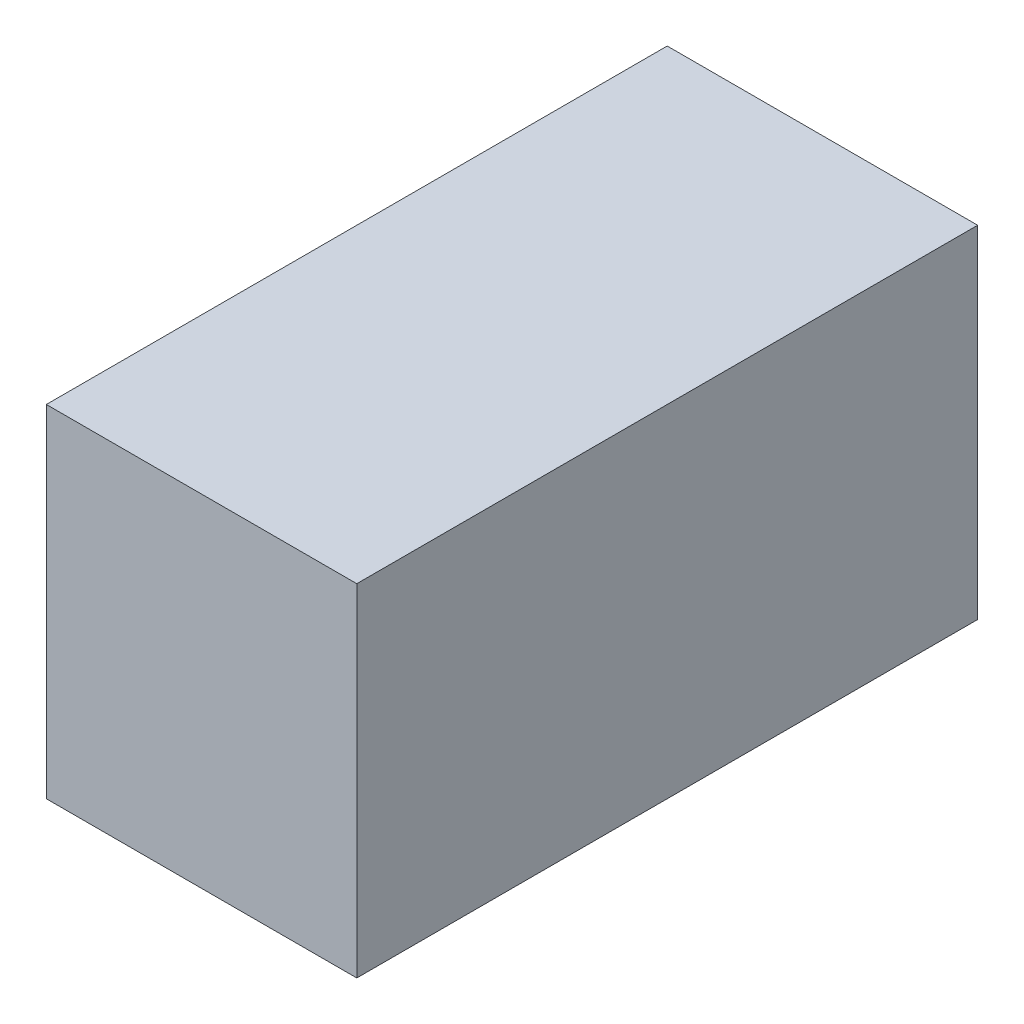
ISO-10303-21;
HEADER;
FILE_DESCRIPTION(('STEP AP214'),'2;1');
FILE_NAME('part.step','',(''),(''),'','','');
FILE_SCHEMA(('AUTOMOTIVE_DESIGN { 1 0 10303 214 1 1 1 1 }'));
ENDSEC;
DATA;
#1=APPLICATION_CONTEXT('core data for automotive mechanical design processes');
#2=APPLICATION_PROTOCOL_DEFINITION('international standard','automotive_design',2000,#1);
#3=PRODUCT_CONTEXT('',#1,'mechanical');
#4=PRODUCT('Part','Part','',(#3));
#5=PRODUCT_RELATED_PRODUCT_CATEGORY('part','',(#4));
#6=PRODUCT_DEFINITION_FORMATION('','',#4);
#7=PRODUCT_DEFINITION_CONTEXT('part definition',#1,'design');
#8=PRODUCT_DEFINITION('design','',#6,#7);
#9=PRODUCT_DEFINITION_SHAPE('','',#8);
#10=(LENGTH_UNIT() NAMED_UNIT(*) SI_UNIT(.MILLI.,.METRE.));
#11=(NAMED_UNIT(*) PLANE_ANGLE_UNIT() SI_UNIT($,.RADIAN.));
#12=(NAMED_UNIT(*) SI_UNIT($,.STERADIAN.) SOLID_ANGLE_UNIT());
#13=UNCERTAINTY_MEASURE_WITH_UNIT(LENGTH_MEASURE(1.E-05),#10,'distance_accuracy_value','');
#14=(GEOMETRIC_REPRESENTATION_CONTEXT(3) GLOBAL_UNCERTAINTY_ASSIGNED_CONTEXT((#13)) GLOBAL_UNIT_ASSIGNED_CONTEXT((#10,
#11,#12)) REPRESENTATION_CONTEXT('',''));
#15=CARTESIAN_POINT('',(0.,0.,0.));
#16=DIRECTION('',(0.,0.,1.));
#17=DIRECTION('',(1.,0.,0.));
#18=AXIS2_PLACEMENT_3D('',#15,#16,#17);
#19=CARTESIAN_POINT('',(0.,0.55,0.));
#20=DIRECTION('',(1.,0.,0.));
#21=DIRECTION('',(0.,0.,-1.));
#22=AXIS2_PLACEMENT_3D('',#19,#20,#21);
#23=PLANE('',#22);
#24=DIRECTION('',(0.,0.,1.));
#25=VECTOR('',#24,1.);
#26=CARTESIAN_POINT('',(0.,0.,0.));
#27=LINE('',#26,#25);
#28=CARTESIAN_POINT('',(0.,0.,-1.));
#29=VERTEX_POINT('',#28);
#30=CARTESIAN_POINT('',(0.,0.,0.));
#31=VERTEX_POINT('',#30);
#32=EDGE_CURVE('E111',#29,#31,#27,.T.);
#33=ORIENTED_EDGE('',*,*,#32,.T.);
#34=DIRECTION('',(0.,-1.,0.));
#35=VECTOR('',#34,1.);
#36=CARTESIAN_POINT('',(0.,0.55,0.));
#37=LINE('',#36,#35);
#38=CARTESIAN_POINT('',(0.,0.55,0.));
#39=VERTEX_POINT('',#38);
#40=EDGE_CURVE('E11',#39,#31,#37,.T.);
#41=ORIENTED_EDGE('',*,*,#40,.F.);
#42=DIRECTION('',(0.,0.,1.));
#43=VECTOR('',#42,1.);
#44=CARTESIAN_POINT('',(0.,0.55,0.));
#45=LINE('',#44,#43);
#46=CARTESIAN_POINT('',(0.,0.55,-1.));
#47=VERTEX_POINT('',#46);
#48=EDGE_CURVE('E95',#47,#39,#45,.T.);
#49=ORIENTED_EDGE('',*,*,#48,.F.);
#50=DIRECTION('',(0.,-1.,0.));
#51=VECTOR('',#50,1.);
#52=CARTESIAN_POINT('',(0.,0.55,-1.));
#53=LINE('',#52,#51);
#54=EDGE_CURVE('E107',#47,#29,#53,.T.);
#55=ORIENTED_EDGE('',*,*,#54,.T.);
#56=EDGE_LOOP('',(#33,#41,#49,#55));
#57=FACE_BOUND('',#56,.T.);
#58=ADVANCED_FACE('F43',(#57),#23,.F.);
#59=CARTESIAN_POINT('',(0.,0.55,0.));
#60=DIRECTION('',(0.,0.,-1.));
#61=DIRECTION('',(-1.,0.,0.));
#62=AXIS2_PLACEMENT_3D('',#59,#60,#61);
#63=PLANE('',#62);
#64=DIRECTION('',(1.,0.,0.));
#65=VECTOR('',#64,1.);
#66=CARTESIAN_POINT('',(0.,0.,0.));
#67=LINE('',#66,#65);
#68=CARTESIAN_POINT('',(0.5,0.,0.));
#69=VERTEX_POINT('',#68);
#70=EDGE_CURVE('E100',#31,#69,#67,.T.);
#71=ORIENTED_EDGE('',*,*,#70,.T.);
#72=DIRECTION('',(0.,-1.,0.));
#73=VECTOR('',#72,1.);
#74=CARTESIAN_POINT('',(0.5,0.55,0.));
#75=LINE('',#74,#73);
#76=CARTESIAN_POINT('',(0.5,0.55,0.));
#77=VERTEX_POINT('',#76);
#78=EDGE_CURVE('E52',#77,#69,#75,.T.);
#79=ORIENTED_EDGE('',*,*,#78,.F.);
#80=DIRECTION('',(1.,0.,0.));
#81=VECTOR('',#80,1.);
#82=CARTESIAN_POINT('',(0.,0.55,0.));
#83=LINE('',#82,#81);
#84=EDGE_CURVE('E90',#39,#77,#83,.T.);
#85=ORIENTED_EDGE('',*,*,#84,.F.);
#86=ORIENTED_EDGE('',*,*,#40,.T.);
#87=EDGE_LOOP('',(#71,#79,#85,#86));
#88=FACE_BOUND('',#87,.T.);
#89=ADVANCED_FACE('F99',(#88),#63,.F.);
#90=CARTESIAN_POINT('',(0.5,0.55,0.));
#91=DIRECTION('',(-1.,0.,0.));
#92=DIRECTION('',(0.,0.,1.));
#93=AXIS2_PLACEMENT_3D('',#90,#91,#92);
#94=PLANE('',#93);
#95=DIRECTION('',(0.,0.,-1.));
#96=VECTOR('',#95,1.);
#97=CARTESIAN_POINT('',(0.5,0.,0.));
#98=LINE('',#97,#96);
#99=CARTESIAN_POINT('',(0.5,0.,-1.));
#100=VERTEX_POINT('',#99);
#101=EDGE_CURVE('E77',#69,#100,#98,.T.);
#102=ORIENTED_EDGE('',*,*,#101,.T.);
#103=DIRECTION('',(0.,-1.,0.));
#104=VECTOR('',#103,1.);
#105=CARTESIAN_POINT('',(0.5,0.55,-1.));
#106=LINE('',#105,#104);
#107=CARTESIAN_POINT('',(0.5,0.55,-1.));
#108=VERTEX_POINT('',#107);
#109=EDGE_CURVE('E102',#108,#100,#106,.T.);
#110=ORIENTED_EDGE('',*,*,#109,.F.);
#111=DIRECTION('',(0.,0.,-1.));
#112=VECTOR('',#111,1.);
#113=CARTESIAN_POINT('',(0.5,0.55,0.));
#114=LINE('',#113,#112);
#115=EDGE_CURVE('E93',#77,#108,#114,.T.);
#116=ORIENTED_EDGE('',*,*,#115,.F.);
#117=ORIENTED_EDGE('',*,*,#78,.T.);
#118=EDGE_LOOP('',(#102,#110,#116,#117));
#119=FACE_BOUND('',#118,.T.);
#120=ADVANCED_FACE('F103',(#119),#94,.F.);
#121=CARTESIAN_POINT('',(0.,0.55,-1.));
#122=DIRECTION('',(0.,0.,1.));
#123=DIRECTION('',(1.,0.,0.));
#124=AXIS2_PLACEMENT_3D('',#121,#122,#123);
#125=PLANE('',#124);
#126=DIRECTION('',(-1.,0.,0.));
#127=VECTOR('',#126,1.);
#128=CARTESIAN_POINT('',(0.,0.,-1.));
#129=LINE('',#128,#127);
#130=EDGE_CURVE('E83',#100,#29,#129,.T.);
#131=ORIENTED_EDGE('',*,*,#130,.T.);
#132=ORIENTED_EDGE('',*,*,#54,.F.);
#133=DIRECTION('',(-1.,0.,0.));
#134=VECTOR('',#133,1.);
#135=CARTESIAN_POINT('',(0.,0.55,-1.));
#136=LINE('',#135,#134);
#137=EDGE_CURVE('E60',#108,#47,#136,.T.);
#138=ORIENTED_EDGE('',*,*,#137,.F.);
#139=ORIENTED_EDGE('',*,*,#109,.T.);
#140=EDGE_LOOP('',(#131,#132,#138,#139));
#141=FACE_BOUND('',#140,.T.);
#142=ADVANCED_FACE('F124',(#141),#125,.F.);
#143=CARTESIAN_POINT('',(0.,0.55,0.));
#144=DIRECTION('',(0.,-1.,0.));
#145=DIRECTION('',(0.,0.,-1.));
#146=AXIS2_PLACEMENT_3D('',#143,#144,#145);
#147=PLANE('',#146);
#148=ORIENTED_EDGE('',*,*,#48,.T.);
#149=ORIENTED_EDGE('',*,*,#84,.T.);
#150=ORIENTED_EDGE('',*,*,#115,.T.);
#151=ORIENTED_EDGE('',*,*,#137,.T.);
#152=EDGE_LOOP('',(#148,#149,#150,#151));
#153=FACE_BOUND('',#152,.T.);
#154=ADVANCED_FACE('F91',(#153),#147,.F.);
#155=CARTESIAN_POINT('',(0.,0.,0.));
#156=DIRECTION('',(0.,-1.,0.));
#157=DIRECTION('',(0.,0.,-1.));
#158=AXIS2_PLACEMENT_3D('',#155,#156,#157);
#159=PLANE('',#158);
#160=ORIENTED_EDGE('',*,*,#32,.F.);
#161=ORIENTED_EDGE('',*,*,#130,.F.);
#162=ORIENTED_EDGE('',*,*,#101,.F.);
#163=ORIENTED_EDGE('',*,*,#70,.F.);
#164=EDGE_LOOP('',(#160,#161,#162,#163));
#165=FACE_BOUND('',#164,.T.);
#166=ADVANCED_FACE('F127',(#165),#159,.T.);
#167=CLOSED_SHELL('',(#58,#89,#120,#142,#154,#166));
#168=MANIFOLD_SOLID_BREP('B2',#167);
#169=ADVANCED_BREP_SHAPE_REPRESENTATION('',(#18,#168),#14);
#170=SHAPE_DEFINITION_REPRESENTATION(#9,#169);
ENDSEC;
END-ISO-10303-21;
